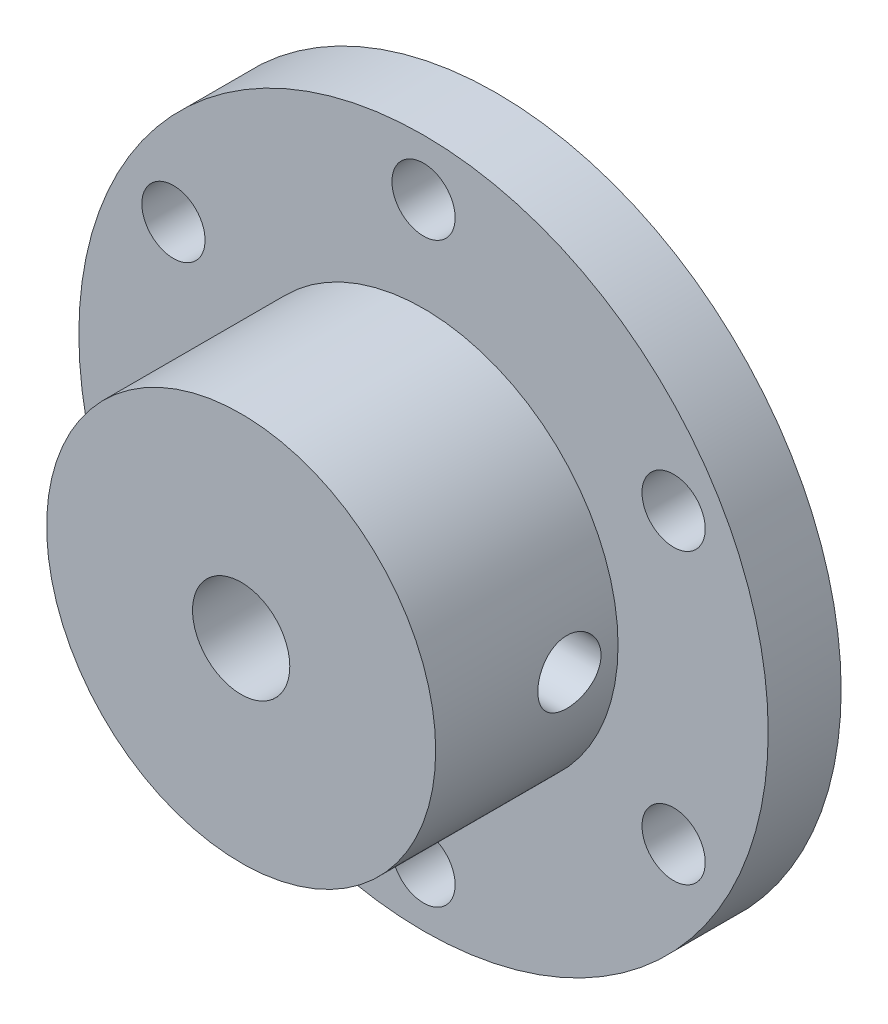
ISO-10303-21;
HEADER;
FILE_DESCRIPTION(('STEP AP214'),'2;1');
FILE_NAME('part.step','',(''),(''),'','','');
FILE_SCHEMA(('AUTOMOTIVE_DESIGN { 1 0 10303 214 1 1 1 1 }'));
ENDSEC;
DATA;
#1=APPLICATION_CONTEXT('core data for automotive mechanical design processes');
#2=APPLICATION_PROTOCOL_DEFINITION('international standard','automotive_design',2000,#1);
#3=PRODUCT_CONTEXT('',#1,'mechanical');
#4=PRODUCT('Part','Part','',(#3));
#5=PRODUCT_RELATED_PRODUCT_CATEGORY('part','',(#4));
#6=PRODUCT_DEFINITION_FORMATION('','',#4);
#7=PRODUCT_DEFINITION_CONTEXT('part definition',#1,'design');
#8=PRODUCT_DEFINITION('design','',#6,#7);
#9=PRODUCT_DEFINITION_SHAPE('','',#8);
#10=(LENGTH_UNIT() NAMED_UNIT(*) SI_UNIT(.MILLI.,.METRE.));
#11=(NAMED_UNIT(*) PLANE_ANGLE_UNIT() SI_UNIT($,.RADIAN.));
#12=(NAMED_UNIT(*) SI_UNIT($,.STERADIAN.) SOLID_ANGLE_UNIT());
#13=UNCERTAINTY_MEASURE_WITH_UNIT(LENGTH_MEASURE(1.E-05),#10,'distance_accuracy_value','');
#14=(GEOMETRIC_REPRESENTATION_CONTEXT(3) GLOBAL_UNCERTAINTY_ASSIGNED_CONTEXT((#13)) GLOBAL_UNIT_ASSIGNED_CONTEXT((#10,
#11,#12)) REPRESENTATION_CONTEXT('',''));
#15=CARTESIAN_POINT('',(0.,0.,0.));
#16=DIRECTION('',(0.,0.,1.));
#17=DIRECTION('',(1.,0.,0.));
#18=AXIS2_PLACEMENT_3D('',#15,#16,#17);
#19=CARTESIAN_POINT('',(0.,0.,6.));
#20=DIRECTION('',(0.,0.,-1.));
#21=DIRECTION('',(-1.,0.,0.));
#22=AXIS2_PLACEMENT_3D('',#19,#20,#21);
#23=CYLINDRICAL_SURFACE('',#22,28.35);
#24=CARTESIAN_POINT('',(0.,0.,6.));
#25=DIRECTION('',(0.,0.,1.));
#26=DIRECTION('',(1.,0.,0.));
#27=AXIS2_PLACEMENT_3D('',#24,#25,#26);
#28=CIRCLE('',#27,28.35);
#29=CARTESIAN_POINT('',(28.35,0.,6.));
#30=VERTEX_POINT('',#29);
#31=EDGE_CURVE('E37',#30,#30,#28,.T.);
#32=ORIENTED_EDGE('',*,*,#31,.F.);
#33=EDGE_LOOP('',(#32));
#34=FACE_BOUND('',#33,.T.);
#35=CARTESIAN_POINT('',(0.,0.,0.));
#36=DIRECTION('',(0.,0.,1.));
#37=DIRECTION('',(1.,0.,0.));
#38=AXIS2_PLACEMENT_3D('',#35,#36,#37);
#39=CIRCLE('',#38,28.35);
#40=CARTESIAN_POINT('',(28.35,0.,0.));
#41=VERTEX_POINT('',#40);
#42=EDGE_CURVE('E41',#41,#41,#39,.T.);
#43=ORIENTED_EDGE('',*,*,#42,.T.);
#44=EDGE_LOOP('',(#43));
#45=FACE_BOUND('',#44,.T.);
#46=ADVANCED_FACE('F31',(#34,#45),#23,.T.);
#47=CARTESIAN_POINT('',(0.,0.,6.));
#48=DIRECTION('',(0.,0.,1.));
#49=DIRECTION('',(1.,0.,0.));
#50=AXIS2_PLACEMENT_3D('',#47,#48,#49);
#51=PLANE('',#50);
#52=CARTESIAN_POINT('',(-20.5681033398804,-11.8750000000001,6.));
#53=DIRECTION('',(0.,0.,1.));
#54=DIRECTION('',(-0.500000000000004,0.866025403784436,0.));
#55=AXIS2_PLACEMENT_3D('',#52,#53,#54);
#56=CIRCLE('',#55,2.6);
#57=CARTESIAN_POINT('',(-21.8681033398804,-9.62333395016056,6.));
#58=VERTEX_POINT('',#57);
#59=EDGE_CURVE('E92',#58,#58,#56,.T.);
#60=ORIENTED_EDGE('',*,*,#59,.F.);
#61=EDGE_LOOP('',(#60));
#62=FACE_BOUND('',#61,.T.);
#63=CARTESIAN_POINT('',(0.,-23.75,6.));
#64=DIRECTION('',(0.,0.,1.));
#65=DIRECTION('',(-1.,0.,0.));
#66=AXIS2_PLACEMENT_3D('',#63,#64,#65);
#67=CIRCLE('',#66,2.6);
#68=CARTESIAN_POINT('',(-2.6,-23.75,6.));
#69=VERTEX_POINT('',#68);
#70=EDGE_CURVE('E86',#69,#69,#67,.T.);
#71=ORIENTED_EDGE('',*,*,#70,.F.);
#72=EDGE_LOOP('',(#71));
#73=FACE_BOUND('',#72,.T.);
#74=CARTESIAN_POINT('',(20.5681033398805,-11.8749999999998,6.));
#75=DIRECTION('',(0.,0.,1.));
#76=DIRECTION('',(-0.499999999999992,-0.866025403784443,0.));
#77=AXIS2_PLACEMENT_3D('',#74,#75,#76);
#78=CIRCLE('',#77,2.6);
#79=CARTESIAN_POINT('',(19.2681033398806,-14.1266660498394,6.));
#80=VERTEX_POINT('',#79);
#81=EDGE_CURVE('E78',#80,#80,#78,.T.);
#82=ORIENTED_EDGE('',*,*,#81,.F.);
#83=EDGE_LOOP('',(#82));
#84=FACE_BOUND('',#83,.T.);
#85=CARTESIAN_POINT('',(20.5681033398803,11.8750000000002,6.));
#86=DIRECTION('',(0.,0.,1.));
#87=DIRECTION('',(0.50000000000001,-0.866025403784433,0.));
#88=AXIS2_PLACEMENT_3D('',#85,#86,#87);
#89=CIRCLE('',#88,2.6);
#90=CARTESIAN_POINT('',(21.8681033398803,9.62333395016071,6.));
#91=VERTEX_POINT('',#90);
#92=EDGE_CURVE('E79',#91,#91,#89,.T.);
#93=ORIENTED_EDGE('',*,*,#92,.F.);
#94=EDGE_LOOP('',(#93));
#95=FACE_BOUND('',#94,.T.);
#96=CARTESIAN_POINT('',(-20.5681033398804,11.875,6.));
#97=DIRECTION('',(0.,0.,1.));
#98=DIRECTION('',(0.499999999999998,0.86602540378444,0.));
#99=AXIS2_PLACEMENT_3D('',#96,#97,#98);
#100=CIRCLE('',#99,2.6);
#101=CARTESIAN_POINT('',(-19.2681033398805,14.1266660498395,6.));
#102=VERTEX_POINT('',#101);
#103=EDGE_CURVE('E71',#102,#102,#100,.T.);
#104=ORIENTED_EDGE('',*,*,#103,.F.);
#105=EDGE_LOOP('',(#104));
#106=FACE_BOUND('',#105,.T.);
#107=CARTESIAN_POINT('',(0.,23.75,6.));
#108=DIRECTION('',(0.,0.,1.));
#109=DIRECTION('',(1.,0.,0.));
#110=AXIS2_PLACEMENT_3D('',#107,#108,#109);
#111=CIRCLE('',#110,2.6);
#112=CARTESIAN_POINT('',(2.6,23.75,6.));
#113=VERTEX_POINT('',#112);
#114=EDGE_CURVE('E65',#113,#113,#111,.T.);
#115=ORIENTED_EDGE('',*,*,#114,.F.);
#116=EDGE_LOOP('',(#115));
#117=FACE_BOUND('',#116,.T.);
#118=CARTESIAN_POINT('',(0.,0.,6.));
#119=DIRECTION('',(0.,0.,1.));
#120=DIRECTION('',(1.,0.,0.));
#121=AXIS2_PLACEMENT_3D('',#118,#119,#120);
#122=CIRCLE('',#121,16.);
#123=CARTESIAN_POINT('',(16.,0.,6.));
#124=VERTEX_POINT('',#123);
#125=EDGE_CURVE('E48',#124,#124,#122,.T.);
#126=ORIENTED_EDGE('',*,*,#125,.F.);
#127=EDGE_LOOP('',(#126));
#128=FACE_BOUND('',#127,.T.);
#129=ORIENTED_EDGE('',*,*,#31,.T.);
#130=EDGE_LOOP('',(#129));
#131=FACE_BOUND('',#130,.T.);
#132=ADVANCED_FACE('F158',(#62,#73,#84,#95,#106,#117,#128,#131),#51,.T.);
#133=CARTESIAN_POINT('',(0.,0.,0.));
#134=DIRECTION('',(0.,0.,1.));
#135=DIRECTION('',(1.,0.,0.));
#136=AXIS2_PLACEMENT_3D('',#133,#134,#135);
#137=PLANE('',#136);
#138=CARTESIAN_POINT('',(-20.5681033398804,-11.8750000000001,0.));
#139=DIRECTION('',(0.,0.,1.));
#140=DIRECTION('',(-0.500000000000004,0.866025403784436,0.));
#141=AXIS2_PLACEMENT_3D('',#138,#139,#140);
#142=CIRCLE('',#141,2.6);
#143=CARTESIAN_POINT('',(-21.8681033398804,-9.62333395016056,0.));
#144=VERTEX_POINT('',#143);
#145=EDGE_CURVE('E74',#144,#144,#142,.F.);
#146=ORIENTED_EDGE('',*,*,#145,.F.);
#147=EDGE_LOOP('',(#146));
#148=FACE_BOUND('',#147,.T.);
#149=CARTESIAN_POINT('',(0.,-23.75,0.));
#150=DIRECTION('',(0.,0.,1.));
#151=DIRECTION('',(-1.,0.,0.));
#152=AXIS2_PLACEMENT_3D('',#149,#150,#151);
#153=CIRCLE('',#152,2.6);
#154=CARTESIAN_POINT('',(-2.6,-23.75,0.));
#155=VERTEX_POINT('',#154);
#156=EDGE_CURVE('E89',#155,#155,#153,.F.);
#157=ORIENTED_EDGE('',*,*,#156,.F.);
#158=EDGE_LOOP('',(#157));
#159=FACE_BOUND('',#158,.T.);
#160=CARTESIAN_POINT('',(20.5681033398805,-11.8749999999998,0.));
#161=DIRECTION('',(0.,0.,1.));
#162=DIRECTION('',(-0.499999999999992,-0.866025403784443,0.));
#163=AXIS2_PLACEMENT_3D('',#160,#161,#162);
#164=CIRCLE('',#163,2.6);
#165=CARTESIAN_POINT('',(19.2681033398806,-14.1266660498394,0.));
#166=VERTEX_POINT('',#165);
#167=EDGE_CURVE('E83',#166,#166,#164,.F.);
#168=ORIENTED_EDGE('',*,*,#167,.F.);
#169=EDGE_LOOP('',(#168));
#170=FACE_BOUND('',#169,.T.);
#171=CARTESIAN_POINT('',(20.5681033398803,11.8750000000002,0.));
#172=DIRECTION('',(0.,0.,1.));
#173=DIRECTION('',(0.50000000000001,-0.866025403784433,0.));
#174=AXIS2_PLACEMENT_3D('',#171,#172,#173);
#175=CIRCLE('',#174,2.6);
#176=CARTESIAN_POINT('',(21.8681033398803,9.62333395016071,0.));
#177=VERTEX_POINT('',#176);
#178=EDGE_CURVE('E75',#177,#177,#175,.F.);
#179=ORIENTED_EDGE('',*,*,#178,.F.);
#180=EDGE_LOOP('',(#179));
#181=FACE_BOUND('',#180,.T.);
#182=CARTESIAN_POINT('',(-20.5681033398804,11.875,0.));
#183=DIRECTION('',(0.,0.,1.));
#184=DIRECTION('',(0.499999999999998,0.86602540378444,0.));
#185=AXIS2_PLACEMENT_3D('',#182,#183,#184);
#186=CIRCLE('',#185,2.6);
#187=CARTESIAN_POINT('',(-19.2681033398805,14.1266660498395,0.));
#188=VERTEX_POINT('',#187);
#189=EDGE_CURVE('E68',#188,#188,#186,.F.);
#190=ORIENTED_EDGE('',*,*,#189,.F.);
#191=EDGE_LOOP('',(#190));
#192=FACE_BOUND('',#191,.T.);
#193=CARTESIAN_POINT('',(0.,23.75,0.));
#194=DIRECTION('',(0.,0.,1.));
#195=DIRECTION('',(1.,0.,0.));
#196=AXIS2_PLACEMENT_3D('',#193,#194,#195);
#197=CIRCLE('',#196,2.6);
#198=CARTESIAN_POINT('',(2.6,23.75,0.));
#199=VERTEX_POINT('',#198);
#200=EDGE_CURVE('E60',#199,#199,#197,.F.);
#201=ORIENTED_EDGE('',*,*,#200,.F.);
#202=EDGE_LOOP('',(#201));
#203=FACE_BOUND('',#202,.T.);
#204=CARTESIAN_POINT('',(0.,0.,0.));
#205=DIRECTION('',(0.,0.,1.));
#206=DIRECTION('',(1.,0.,0.));
#207=AXIS2_PLACEMENT_3D('',#204,#205,#206);
#208=CIRCLE('',#207,11.);
#209=CARTESIAN_POINT('',(11.,0.,0.));
#210=VERTEX_POINT('',#209);
#211=EDGE_CURVE('E10',#210,#210,#208,.F.);
#212=ORIENTED_EDGE('',*,*,#211,.F.);
#213=EDGE_LOOP('',(#212));
#214=FACE_BOUND('',#213,.T.);
#215=ORIENTED_EDGE('',*,*,#42,.F.);
#216=EDGE_LOOP('',(#215));
#217=FACE_BOUND('',#216,.T.);
#218=ADVANCED_FACE('F156',(#148,#159,#170,#181,#192,#203,#214,#217),#137,.F.);
#219=CARTESIAN_POINT('',(0.,0.,21.));
#220=DIRECTION('',(0.,0.,-1.));
#221=DIRECTION('',(-1.,0.,0.));
#222=AXIS2_PLACEMENT_3D('',#219,#220,#221);
#223=CYLINDRICAL_SURFACE('',#222,16.);
#224=CARTESIAN_POINT('',(16.,0.,7.4));
#225=CARTESIAN_POINT('',(15.9999975518525,0.145019165622541,7.400005860033));
#226=CARTESIAN_POINT('',(15.998007815557,0.290118777639167,7.41217399437673));
#227=CARTESIAN_POINT('',(15.9902619371879,0.576252000590273,7.46050684932739));
#228=CARTESIAN_POINT('',(15.9845022787969,0.717281687035817,7.49669397359803));
#229=CARTESIAN_POINT('',(15.9698628987647,0.991093594297769,7.59194634492627));
#230=CARTESIAN_POINT('',(15.9609856797801,1.12388233031244,7.65099324492504));
#231=CARTESIAN_POINT('',(15.941088512354,1.37764964720681,7.79024181657666));
#232=CARTESIAN_POINT('',(15.9300688225734,1.49862965111127,7.87044093493452));
#233=CARTESIAN_POINT('',(15.9069970915093,1.72646494930587,8.05049468884231));
#234=CARTESIAN_POINT('',(15.8949373686679,1.83319709427538,8.15050418657474));
#235=CARTESIAN_POINT('',(15.8712039142321,2.02844349150952,8.3670064758371));
#236=CARTESIAN_POINT('',(15.859530206462,2.1169566210824,8.48350028241674));
#237=CARTESIAN_POINT('',(15.8378161048365,2.27374233291168,8.73050557038933));
#238=CARTESIAN_POINT('',(15.8277856376571,2.34189381199137,8.86109487026781));
#239=CARTESIAN_POINT('',(15.8105998564937,2.45524735239402,9.13205768923801));
#240=CARTESIAN_POINT('',(15.8034443581267,2.50045088550628,9.27243058019251));
#241=CARTESIAN_POINT('',(15.7928949187579,2.5662387819247,9.55767306751007));
#242=CARTESIAN_POINT('',(15.7894685806565,2.58703530727345,9.70249251051031));
#243=CARTESIAN_POINT('',(15.7866673145195,2.60407651839143,9.99360287646867));
#244=CARTESIAN_POINT('',(15.7872921138754,2.60032285618713,10.1398936997535));
#245=CARTESIAN_POINT('',(15.792492936895,2.5685432048478,10.4282837553786));
#246=CARTESIAN_POINT('',(15.7970302480111,2.54075501837767,10.5704099922873));
#247=CARTESIAN_POINT('',(15.8094842884277,2.46206807385545,10.8479556544906));
#248=CARTESIAN_POINT('',(15.8174011283977,2.41116855897298,10.9833748599879));
#249=CARTESIAN_POINT('',(15.8357642622092,2.28746109805666,11.2443773241013));
#250=CARTESIAN_POINT('',(15.8462219734499,2.2145538916015,11.3699126999328));
#251=CARTESIAN_POINT('',(15.8684805204019,2.04897114492228,11.6070579521655));
#252=CARTESIAN_POINT('',(15.8802814592449,1.95629408631178,11.7186667579184));
#253=CARTESIAN_POINT('',(15.9040671416711,1.75250422023619,11.9261676650082));
#254=CARTESIAN_POINT('',(15.9160524138607,1.64118727022561,12.0218593275903));
#255=CARTESIAN_POINT('',(15.9387277836054,1.40396930678376,12.1932351460248));
#256=CARTESIAN_POINT('',(15.9494178735614,1.27806820779389,12.268919184493));
#257=CARTESIAN_POINT('',(15.9683124927782,1.01507117727731,12.3981475356042));
#258=CARTESIAN_POINT('',(15.9765150982258,0.877966684577824,12.4516747238223));
#259=CARTESIAN_POINT('',(15.9894949378792,0.596550991776668,12.5348869796715));
#260=CARTESIAN_POINT('',(15.9942724443176,0.452240365405991,12.564573942186));
#261=CARTESIAN_POINT('',(15.9998273274762,0.162237052175142,12.5989926713094));
#262=CARTESIAN_POINT('',(16.0006488246688,0.0165778499538006,12.6039997024925));
#263=CARTESIAN_POINT('',(15.9983197787696,-0.273498686511127,12.5896494658514));
#264=CARTESIAN_POINT('',(15.995169380715,-0.417916065907044,12.5702930876776));
#265=CARTESIAN_POINT('',(15.9852778322002,-0.700563507141241,12.5079944292099));
#266=CARTESIAN_POINT('',(15.9785573499514,-0.838824267874382,12.4651878644649));
#267=CARTESIAN_POINT('',(15.9622763015789,-1.10620674757079,12.357348226564));
#268=CARTESIAN_POINT('',(15.9527155825726,-1.2353279741128,12.292313956919));
#269=CARTESIAN_POINT('',(15.9317056456613,-1.48196559776625,12.1412305759297));
#270=CARTESIAN_POINT('',(15.9202411780516,-1.59937491764035,12.0550088262938));
#271=CARTESIAN_POINT('',(15.8967429940485,-1.81815609227847,11.8642362281294));
#272=CARTESIAN_POINT('',(15.8847092385126,-1.91952684218722,11.759684117915));
#273=CARTESIAN_POINT('',(15.861286806495,-2.10436883201893,11.5339864162734));
#274=CARTESIAN_POINT('',(15.8499056278516,-2.1876544619935,11.4126879142364));
#275=CARTESIAN_POINT('',(15.8292151115576,-2.33266734053808,11.1576604671493));
#276=CARTESIAN_POINT('',(15.8199057106323,-2.39439524754049,11.0239319019056));
#277=CARTESIAN_POINT('',(15.8044685529145,-2.49426022583075,10.7483683048658));
#278=CARTESIAN_POINT('',(15.7983281672888,-2.53249105346396,10.6065679898655));
#279=CARTESIAN_POINT('',(15.789892100647,-2.58457259245705,10.3184507365549));
#280=CARTESIAN_POINT('',(15.7875961034369,-2.5984253088787,10.1721341707066));
#281=CARTESIAN_POINT('',(15.7871219367981,-2.60130360164379,9.88099032581017));
#282=CARTESIAN_POINT('',(15.7888953245053,-2.59062124754973,9.73616592977366));
#283=CARTESIAN_POINT('',(15.7962541732009,-2.54536271366947,9.45040383344645));
#284=CARTESIAN_POINT('',(15.8018396235564,-2.51078660053051,9.30946612231569));
#285=CARTESIAN_POINT('',(15.8161752287004,-2.41883172557042,9.03558276759314));
#286=CARTESIAN_POINT('',(15.8249220621644,-2.36147688867156,8.90262890654861));
#287=CARTESIAN_POINT('',(15.8445983040299,-2.22562239095935,8.6481834323924));
#288=CARTESIAN_POINT('',(15.855527811869,-2.14712176673498,8.52669234187001));
#289=CARTESIAN_POINT('',(15.8784920726711,-1.97015676038599,8.29714327721146));
#290=CARTESIAN_POINT('',(15.8905379049704,-1.87147711552398,8.18925234016369));
#291=CARTESIAN_POINT('',(15.9142881228198,-1.65740958299184,7.99145994230406));
#292=CARTESIAN_POINT('',(15.9259924288051,-1.54201783868795,7.90156264530333));
#293=CARTESIAN_POINT('',(15.9478291613459,-1.29690761070655,7.74177541359853));
#294=CARTESIAN_POINT('',(15.9579508180885,-1.1671004465741,7.67202003835235));
#295=CARTESIAN_POINT('',(15.9753768765635,-0.897501815361569,7.55541067805837));
#296=CARTESIAN_POINT('',(15.9826841117636,-0.757720558855373,7.50853364706595));
#297=CARTESIAN_POINT('',(15.9920442535747,-0.514478104994399,7.44930629219604));
#298=CARTESIAN_POINT('',(15.9950118750673,-0.412496524331958,7.43084568967443));
#299=CARTESIAN_POINT('',(15.9989906066281,-0.207023613848418,7.40619054922839));
#300=CARTESIAN_POINT('',(16.0000017477853,-0.103532308043563,7.39999581639614));
#301=CARTESIAN_POINT('',(16.,0.,7.4));
#302=B_SPLINE_CURVE_WITH_KNOTS('',3,(#224,#225,#226,#227,#228,#229,#230,#231,#232,#233,#234,
#235,#236,#237,#238,#239,#240,#241,#242,#243,#244,#245,#246,#247,#248,#249,#250,#251,#252,#253,
#254,#255,#256,#257,#258,#259,#260,#261,#262,#263,#264,#265,#266,#267,#268,#269,#270,#271,#272,
#273,#274,#275,#276,#277,#278,#279,#280,#281,#282,#283,#284,#285,#286,#287,#288,#289,#290,#291,
#292,#293,#294,#295,#296,#297,#298,#299,#300,#301),.UNSPECIFIED.,.T.,.F.,(4,2,2,2,2,2,2,2,2,2,2,
2,2,2,2,2,2,2,2,2,2,2,2,2,2,2,2,2,2,2,2,2,2,2,2,2,2,2,4),(0.,0.434679088417318,
0.869764193703607,1.30450082494282,1.73918500290158,2.17741177975745,2.61566555293407,
3.05647624757063,3.49725866680267,3.93418044388563,4.37107282001553,4.80369130704004,
5.23632396211356,5.67093782244235,6.10558507449936,6.54534792691676,6.98511335935419,
7.42521804273336,7.86528774197792,8.30043789444196,8.73557215749171,9.16821432936311,
9.60087979348197,10.0371949046106,10.4735400592753,10.9141714688839,11.3547894192148,
11.7936376358453,12.2324497562046,12.6660652990585,13.0996796324263,13.5328397318637,
13.9660195695974,14.4040871007936,14.8422558859345,15.2832875284259,15.7238739867125,
16.0342056881841,16.344532458366),.UNSPECIFIED.);
#303=CARTESIAN_POINT('',(16.,0.,7.4));
#304=VERTEX_POINT('',#303);
#305=EDGE_CURVE('E82',#304,#304,#302,.T.);
#306=ORIENTED_EDGE('',*,*,#305,.F.);
#307=EDGE_LOOP('',(#306));
#308=FACE_BOUND('',#307,.T.);
#309=CARTESIAN_POINT('',(0.,0.,21.));
#310=DIRECTION('',(0.,0.,1.));
#311=DIRECTION('',(1.,0.,0.));
#312=AXIS2_PLACEMENT_3D('',#309,#310,#311);
#313=CIRCLE('',#312,16.);
#314=CARTESIAN_POINT('',(16.,0.,21.));
#315=VERTEX_POINT('',#314);
#316=EDGE_CURVE('E46',#315,#315,#313,.T.);
#317=ORIENTED_EDGE('',*,*,#316,.F.);
#318=EDGE_LOOP('',(#317));
#319=FACE_BOUND('',#318,.T.);
#320=ORIENTED_EDGE('',*,*,#125,.T.);
#321=EDGE_LOOP('',(#320));
#322=FACE_BOUND('',#321,.T.);
#323=ADVANCED_FACE('F152',(#308,#319,#322),#223,.T.);
#324=CARTESIAN_POINT('',(0.,0.,21.));
#325=DIRECTION('',(0.,0.,1.));
#326=DIRECTION('',(1.,0.,0.));
#327=AXIS2_PLACEMENT_3D('',#324,#325,#326);
#328=PLANE('',#327);
#329=CARTESIAN_POINT('',(0.,0.,21.));
#330=DIRECTION('',(0.,0.,1.));
#331=DIRECTION('',(1.,0.,0.));
#332=AXIS2_PLACEMENT_3D('',#329,#330,#331);
#333=CIRCLE('',#332,4.);
#334=CARTESIAN_POINT('',(4.,0.,21.));
#335=VERTEX_POINT('',#334);
#336=EDGE_CURVE('E57',#335,#335,#333,.T.);
#337=ORIENTED_EDGE('',*,*,#336,.F.);
#338=EDGE_LOOP('',(#337));
#339=FACE_BOUND('',#338,.T.);
#340=ORIENTED_EDGE('',*,*,#316,.T.);
#341=EDGE_LOOP('',(#340));
#342=FACE_BOUND('',#341,.T.);
#343=ADVANCED_FACE('F148',(#339,#342),#328,.T.);
#344=CARTESIAN_POINT('',(0.,0.,-5.));
#345=DIRECTION('',(0.,0.,1.));
#346=DIRECTION('',(1.,0.,0.));
#347=AXIS2_PLACEMENT_3D('',#344,#345,#346);
#348=CYLINDRICAL_SURFACE('',#347,11.);
#349=CARTESIAN_POINT('',(0.,0.,-5.));
#350=DIRECTION('',(0.,0.,-1.));
#351=DIRECTION('',(-1.,0.,0.));
#352=AXIS2_PLACEMENT_3D('',#349,#350,#351);
#353=CIRCLE('',#352,11.);
#354=CARTESIAN_POINT('',(-11.,0.,-5.));
#355=VERTEX_POINT('',#354);
#356=EDGE_CURVE('E51',#355,#355,#353,.T.);
#357=ORIENTED_EDGE('',*,*,#356,.F.);
#358=EDGE_LOOP('',(#357));
#359=FACE_BOUND('',#358,.T.);
#360=ORIENTED_EDGE('',*,*,#211,.T.);
#361=EDGE_LOOP('',(#360));
#362=FACE_BOUND('',#361,.T.);
#363=ADVANCED_FACE('F144',(#359,#362),#348,.T.);
#364=CARTESIAN_POINT('',(0.,0.,-5.));
#365=DIRECTION('',(0.,0.,-1.));
#366=DIRECTION('',(-1.,0.,0.));
#367=AXIS2_PLACEMENT_3D('',#364,#365,#366);
#368=PLANE('',#367);
#369=CARTESIAN_POINT('',(0.,0.,-5.));
#370=DIRECTION('',(0.,0.,1.));
#371=DIRECTION('',(1.,0.,0.));
#372=AXIS2_PLACEMENT_3D('',#369,#370,#371);
#373=CIRCLE('',#372,4.);
#374=CARTESIAN_POINT('',(4.,0.,-5.));
#375=VERTEX_POINT('',#374);
#376=EDGE_CURVE('E56',#375,#375,#373,.T.);
#377=ORIENTED_EDGE('',*,*,#376,.T.);
#378=EDGE_LOOP('',(#377));
#379=FACE_BOUND('',#378,.T.);
#380=ORIENTED_EDGE('',*,*,#356,.T.);
#381=EDGE_LOOP('',(#380));
#382=FACE_BOUND('',#381,.T.);
#383=ADVANCED_FACE('F140',(#379,#382),#368,.T.);
#384=CARTESIAN_POINT('',(0.,0.,-5.));
#385=DIRECTION('',(0.,0.,1.));
#386=DIRECTION('',(1.,0.,0.));
#387=AXIS2_PLACEMENT_3D('',#384,#385,#386);
#388=CYLINDRICAL_SURFACE('',#387,4.);
#389=CARTESIAN_POINT('',(4.00000000000001,0.,7.4));
#390=CARTESIAN_POINT('',(3.99999329691887,-0.131242329840402,7.40000738126002));
#391=CARTESIAN_POINT('',(3.99347988058591,-0.26254087997631,7.40999708649455));
#392=CARTESIAN_POINT('',(3.96805748738894,-0.52099139192231,7.44937287000064));
#393=CARTESIAN_POINT('',(3.94913797434839,-0.648139732626245,7.47877543525755));
#394=CARTESIAN_POINT('',(3.90078759906248,-0.894153597137369,7.55520688955142));
#395=CARTESIAN_POINT('',(3.87140638518175,-1.01305512679099,7.60215257495925));
#396=CARTESIAN_POINT('',(3.8045247484509,-1.24084842839767,7.71170628677316));
#397=CARTESIAN_POINT('',(3.76702351965728,-1.3497392052146,7.77431586797862));
#398=CARTESIAN_POINT('',(3.68325347012659,-1.56461434967278,7.91910183329293));
#399=CARTESIAN_POINT('',(3.63651545151144,-1.66960870737682,8.00247034493663));
#400=CARTESIAN_POINT('',(3.54025458179931,-1.86507260364924,8.18360410574952));
#401=CARTESIAN_POINT('',(3.49072792339419,-1.9555216008489,8.28138934774511));
#402=CARTESIAN_POINT('',(3.38558669465042,-2.13305930241868,8.50552739909667));
#403=CARTESIAN_POINT('',(3.33016214511496,-2.21764773761769,8.63396599830677));
#404=CARTESIAN_POINT('',(3.22801420162754,-2.36387198159628,8.90642481317717));
#405=CARTESIAN_POINT('',(3.18127587306569,-2.42554737172189,9.05041759878877));
#406=CARTESIAN_POINT('',(3.11539311765711,-2.50925136145637,9.30955747553016));
#407=CARTESIAN_POINT('',(3.09219132576584,-2.53752995825082,9.42164521861647));
#408=CARTESIAN_POINT('',(3.05771041530277,-2.57898335699173,9.65029679368884));
#409=CARTESIAN_POINT('',(3.04641228509143,-2.59218224597557,9.7668531791267));
#410=CARTESIAN_POINT('',(3.03746806038309,-2.60266135280388,10.0016298561429));
#411=CARTESIAN_POINT('',(3.03986891717852,-2.59988682378099,10.1198544831345));
#412=CARTESIAN_POINT('',(3.05803219832116,-2.57849148954916,10.3538522603983));
#413=CARTESIAN_POINT('',(3.07380580320714,-2.55985742462454,10.46962327624));
#414=CARTESIAN_POINT('',(3.11558534759959,-2.50881501786101,10.6916580375893));
#415=CARTESIAN_POINT('',(3.14121548827324,-2.4769094003533,10.7981125106191));
#416=CARTESIAN_POINT('',(3.19981705285506,-2.40072387206794,11.0043007802708));
#417=CARTESIAN_POINT('',(3.23279089307918,-2.35643988717874,11.1040323507368));
#418=CARTESIAN_POINT('',(3.31021385739157,-2.24673614480251,11.3148988685634));
#419=CARTESIAN_POINT('',(3.3556433242705,-2.17886980217695,11.4243987256045));
#420=CARTESIAN_POINT('',(3.44875456395806,-2.02828712582731,11.631714922157));
#421=CARTESIAN_POINT('',(3.49643900487366,-1.94555285901557,11.7295169122504));
#422=CARTESIAN_POINT('',(3.59951924333919,-1.74873460092104,11.9301085195407));
#423=CARTESIAN_POINT('',(3.65461273597688,-1.63168281359842,12.0301736971629));
#424=CARTESIAN_POINT('',(3.75705675925733,-1.37948895098043,12.2092655039682));
#425=CARTESIAN_POINT('',(3.80441521846604,-1.24436566112746,12.2883137288184));
#426=CARTESIAN_POINT('',(3.87810197822686,-0.987177593697824,12.4086200970024));
#427=CARTESIAN_POINT('',(3.90673767899132,-0.867825846065371,12.4542618689402));
#428=CARTESIAN_POINT('',(3.95335158387484,-0.621803922247494,12.5278062967084));
#429=CARTESIAN_POINT('',(3.97133854602048,-0.495139854433106,12.5557235314094));
#430=CARTESIAN_POINT('',(3.99505026067922,-0.237423817982841,12.5924169717052));
#431=CARTESIAN_POINT('',(4.00072966012438,-0.106357421515167,12.6011223843623));
#432=CARTESIAN_POINT('',(3.99911931552079,0.155513974751281,12.5986452674804));
#433=CARTESIAN_POINT('',(3.9918293542577,0.286318970135309,12.5874624048472));
#434=CARTESIAN_POINT('',(3.96581617517835,0.535832409189388,12.5471382819573));
#435=CARTESIAN_POINT('',(3.94779725175815,0.654798018157413,12.5191023253737));
#436=CARTESIAN_POINT('',(3.90242300909489,0.885994589797185,12.4473811532236));
#437=CARTESIAN_POINT('',(3.87506617651225,0.998224457378542,12.4036934010065));
#438=CARTESIAN_POINT('',(3.81084256295547,1.22143058424602,12.2987741796295));
#439=CARTESIAN_POINT('',(3.77344664526003,1.3317766276134,12.2365337702525));
#440=CARTESIAN_POINT('',(3.69298130183549,1.54093180569865,12.097926552364));
#441=CARTESIAN_POINT('',(3.64990778597085,1.63973252544577,12.0215495436746));
#442=CARTESIAN_POINT('',(3.55409295784261,1.83914998324802,11.8433890522977));
#443=CARTESIAN_POINT('',(3.50088886534182,1.93766759539933,11.7395021130206));
#444=CARTESIAN_POINT('',(3.3956438319936,2.11669261988643,11.5165942077913));
#445=CARTESIAN_POINT('',(3.34360337235282,2.19719270088575,11.3975671120893));
#446=CARTESIAN_POINT('',(3.25220537921942,2.32999289851312,11.1607308489132));
#447=CARTESIAN_POINT('',(3.21207543674154,2.38451159546739,11.0444705590162));
#448=CARTESIAN_POINT('',(3.14178831224712,2.4763952519929,10.8025770418024));
#449=CARTESIAN_POINT('',(3.11161319411396,2.51379111036201,10.6769611772152));
#450=CARTESIAN_POINT('',(3.0692934895664,2.56522627052098,10.4383770125928));
#451=CARTESIAN_POINT('',(3.05511753152745,2.58193539978499,10.3263540057634));
#452=CARTESIAN_POINT('',(3.03930433313111,2.6005371868811,10.1002347008403));
#453=CARTESIAN_POINT('',(3.03765740728438,2.60244128967071,9.98614007261254));
#454=CARTESIAN_POINT('',(3.04714201327667,2.59132574649897,9.75933297558345));
#455=CARTESIAN_POINT('',(3.05826410933804,2.57831712043633,9.64661954830303));
#456=CARTESIAN_POINT('',(3.09162789439484,2.53820790097824,9.42538703012019));
#457=CARTESIAN_POINT('',(3.11388388764562,2.51108917785943,9.31687352877944));
#458=CARTESIAN_POINT('',(3.17455377484889,2.43418115457623,9.07522359122063));
#459=CARTESIAN_POINT('',(3.21579043461171,2.38007932598737,8.94417788011513));
#460=CARTESIAN_POINT('',(3.30612081416593,2.25291901658979,8.69460918405456));
#461=CARTESIAN_POINT('',(3.35522523949556,2.17983462114018,8.57610363240639));
#462=CARTESIAN_POINT('',(3.45667900495331,2.01515794084205,8.35110588997306));
#463=CARTESIAN_POINT('',(3.50906686476138,1.92329614569848,8.24482856708459));
#464=CARTESIAN_POINT('',(3.61161392590105,1.72305889643047,8.04786851587868));
#465=CARTESIAN_POINT('',(3.66177258968263,1.61467948684425,7.95718953398671));
#466=CARTESIAN_POINT('',(3.76028651184461,1.37081527561855,7.78522804376525));
#467=CARTESIAN_POINT('',(3.80795408931363,1.23370112020267,7.70580535149122));
#468=CARTESIAN_POINT('',(3.8693611012282,1.01672423622726,7.6057087030814));
#469=CARTESIAN_POINT('',(3.88814289000377,0.942542349294445,7.57552330986037));
#470=CARTESIAN_POINT('',(3.92179078701731,0.790932764694422,7.5219198025447));
#471=CARTESIAN_POINT('',(3.93665878835666,0.713506657344975,7.49849841616152));
#472=CARTESIAN_POINT('',(3.96583403439342,0.531962182410129,7.45279703410458));
#473=CARTESIAN_POINT('',(3.97857524969429,0.426930692841303,7.43306300572254));
#474=CARTESIAN_POINT('',(3.99565973196604,0.214611549942163,7.40666340225019));
#475=CARTESIAN_POINT('',(4.00000548150374,0.107324573055882,7.3999939639095));
#476=CARTESIAN_POINT('',(4.00000000000001,0.,7.4));
#477=B_SPLINE_CURVE_WITH_KNOTS('',3,(#389,#390,#391,#392,#393,#394,#395,#396,#397,#398,#399,
#400,#401,#402,#403,#404,#405,#406,#407,#408,#409,#410,#411,#412,#413,#414,#415,#416,#417,#418,
#419,#420,#421,#422,#423,#424,#425,#426,#427,#428,#429,#430,#431,#432,#433,#434,#435,#436,#437,
#438,#439,#440,#441,#442,#443,#444,#445,#446,#447,#448,#449,#450,#451,#452,#453,#454,#455,#456,
#457,#458,#459,#460,#461,#462,#463,#464,#465,#466,#467,#468,#469,#470,#471,#472,#473,#474,#475,
#476),.UNSPECIFIED.,.T.,.F.,(4,2,2,2,2,2,2,2,2,2,2,2,2,2,2,2,2,2,2,2,2,2,2,2,2,2,2,2,2,2,2,2,2,
2,2,2,2,2,2,2,2,2,2,4),(0.,0.393303969432377,0.786942395104627,1.1787370878649,1.57057068563366,
1.99490086832629,2.419825137127,2.90794425842807,3.39521620935952,3.74750251178101,
4.09922531195304,4.45215431353109,4.80537867939459,5.1462917867135,5.48731723168751,
5.89565988937284,6.30449842018327,6.79278996236955,7.28057781136886,7.67176869156947,
8.06263738930539,8.45494399662145,8.8472571744554,9.21628489699287,9.58537245408335,
9.98013330852133,10.3751801185911,10.8315540068116,11.288113257406,11.6902028988748,
12.0915640670411,12.4324642576701,12.7731008907508,13.1134859694145,13.4543094846403,
13.8949021129378,14.3360994206592,14.7841406255338,15.2322892916033,15.7254702477647,
15.9718878198455,16.2181859796628,16.5399089195223,16.8615367102804),.UNSPECIFIED.);
#478=CARTESIAN_POINT('',(4.00000000000001,0.,7.4));
#479=VERTEX_POINT('',#478);
#480=EDGE_CURVE('E105',#479,#479,#477,.T.);
#481=ORIENTED_EDGE('',*,*,#480,.F.);
#482=EDGE_LOOP('',(#481));
#483=FACE_BOUND('',#482,.T.);
#484=ORIENTED_EDGE('',*,*,#376,.F.);
#485=EDGE_LOOP('',(#484));
#486=FACE_BOUND('',#485,.T.);
#487=ORIENTED_EDGE('',*,*,#336,.T.);
#488=EDGE_LOOP('',(#487));
#489=FACE_BOUND('',#488,.T.);
#490=ADVANCED_FACE('F136',(#483,#486,#489),#388,.F.);
#491=CARTESIAN_POINT('',(0.,23.75,-5.001));
#492=DIRECTION('',(0.,0.,1.));
#493=DIRECTION('',(1.,0.,0.));
#494=AXIS2_PLACEMENT_3D('',#491,#492,#493);
#495=CYLINDRICAL_SURFACE('',#494,2.6);
#496=ORIENTED_EDGE('',*,*,#114,.T.);
#497=EDGE_LOOP('',(#496));
#498=FACE_BOUND('',#497,.T.);
#499=ORIENTED_EDGE('',*,*,#200,.T.);
#500=EDGE_LOOP('',(#499));
#501=FACE_BOUND('',#500,.T.);
#502=ADVANCED_FACE('F132',(#498,#501),#495,.F.);
#503=CARTESIAN_POINT('',(-20.5681033398804,11.875,-5.001));
#504=DIRECTION('',(0.,0.,1.));
#505=DIRECTION('',(0.499999999999998,0.86602540378444,0.));
#506=AXIS2_PLACEMENT_3D('',#503,#504,#505);
#507=CYLINDRICAL_SURFACE('',#506,2.6);
#508=ORIENTED_EDGE('',*,*,#103,.T.);
#509=EDGE_LOOP('',(#508));
#510=FACE_BOUND('',#509,.T.);
#511=ORIENTED_EDGE('',*,*,#189,.T.);
#512=EDGE_LOOP('',(#511));
#513=FACE_BOUND('',#512,.T.);
#514=ADVANCED_FACE('F128',(#510,#513),#507,.F.);
#515=CARTESIAN_POINT('',(20.5681033398803,11.8750000000002,-5.001));
#516=DIRECTION('',(0.,0.,1.));
#517=DIRECTION('',(0.50000000000001,-0.866025403784433,0.));
#518=AXIS2_PLACEMENT_3D('',#515,#516,#517);
#519=CYLINDRICAL_SURFACE('',#518,2.6);
#520=ORIENTED_EDGE('',*,*,#92,.T.);
#521=EDGE_LOOP('',(#520));
#522=FACE_BOUND('',#521,.T.);
#523=ORIENTED_EDGE('',*,*,#178,.T.);
#524=EDGE_LOOP('',(#523));
#525=FACE_BOUND('',#524,.T.);
#526=ADVANCED_FACE('F124',(#522,#525),#519,.F.);
#527=CARTESIAN_POINT('',(20.5681033398805,-11.8749999999998,-5.001));
#528=DIRECTION('',(0.,0.,1.));
#529=DIRECTION('',(-0.499999999999992,-0.866025403784443,0.));
#530=AXIS2_PLACEMENT_3D('',#527,#528,#529);
#531=CYLINDRICAL_SURFACE('',#530,2.6);
#532=ORIENTED_EDGE('',*,*,#81,.T.);
#533=EDGE_LOOP('',(#532));
#534=FACE_BOUND('',#533,.T.);
#535=ORIENTED_EDGE('',*,*,#167,.T.);
#536=EDGE_LOOP('',(#535));
#537=FACE_BOUND('',#536,.T.);
#538=ADVANCED_FACE('F120',(#534,#537),#531,.F.);
#539=CARTESIAN_POINT('',(0.,-23.75,-5.001));
#540=DIRECTION('',(0.,0.,1.));
#541=DIRECTION('',(-1.,0.,0.));
#542=AXIS2_PLACEMENT_3D('',#539,#540,#541);
#543=CYLINDRICAL_SURFACE('',#542,2.6);
#544=ORIENTED_EDGE('',*,*,#70,.T.);
#545=EDGE_LOOP('',(#544));
#546=FACE_BOUND('',#545,.T.);
#547=ORIENTED_EDGE('',*,*,#156,.T.);
#548=EDGE_LOOP('',(#547));
#549=FACE_BOUND('',#548,.T.);
#550=ADVANCED_FACE('F116',(#546,#549),#543,.F.);
#551=CARTESIAN_POINT('',(-20.5681033398804,-11.8750000000001,-5.001));
#552=DIRECTION('',(0.,0.,1.));
#553=DIRECTION('',(-0.500000000000004,0.866025403784436,0.));
#554=AXIS2_PLACEMENT_3D('',#551,#552,#553);
#555=CYLINDRICAL_SURFACE('',#554,2.6);
#556=ORIENTED_EDGE('',*,*,#59,.T.);
#557=EDGE_LOOP('',(#556));
#558=FACE_BOUND('',#557,.T.);
#559=ORIENTED_EDGE('',*,*,#145,.T.);
#560=EDGE_LOOP('',(#559));
#561=FACE_BOUND('',#560,.T.);
#562=ADVANCED_FACE('F113',(#558,#561),#555,.F.);
#563=CARTESIAN_POINT('',(-28.351,0.,10.));
#564=DIRECTION('',(1.,0.,0.));
#565=DIRECTION('',(0.,0.,-1.));
#566=AXIS2_PLACEMENT_3D('',#563,#564,#565);
#567=CYLINDRICAL_SURFACE('',#566,2.6);
#568=ORIENTED_EDGE('',*,*,#480,.T.);
#569=EDGE_LOOP('',(#568));
#570=FACE_BOUND('',#569,.T.);
#571=ORIENTED_EDGE('',*,*,#305,.T.);
#572=EDGE_LOOP('',(#571));
#573=FACE_BOUND('',#572,.T.);
#574=ADVANCED_FACE('F109',(#570,#573),#567,.F.);
#575=CLOSED_SHELL('',(#46,#132,#218,#323,#343,#363,#383,#490,#502,#514,#526,#538,#550,#562,#574));
#576=MANIFOLD_SOLID_BREP('B2',#575);
#577=ADVANCED_BREP_SHAPE_REPRESENTATION('',(#18,#576),#14);
#578=SHAPE_DEFINITION_REPRESENTATION(#9,#577);
ENDSEC;
END-ISO-10303-21;
